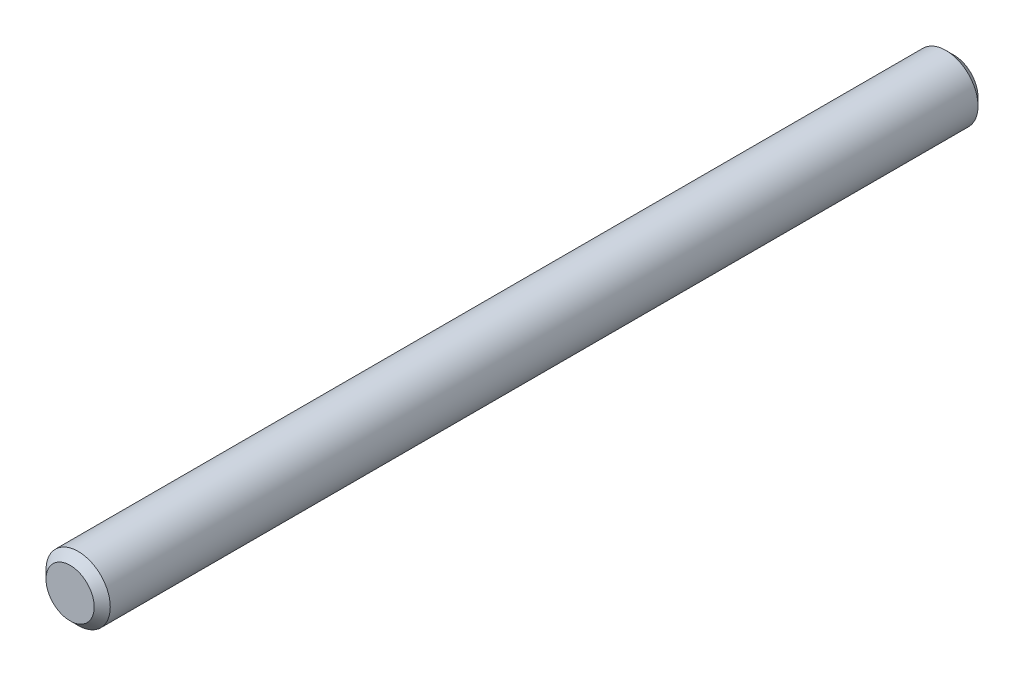
ISO-10303-21;
HEADER;
FILE_DESCRIPTION(('STEP AP214'),'2;1');
FILE_NAME('part.step','',(''),(''),'','','');
FILE_SCHEMA(('AUTOMOTIVE_DESIGN { 1 0 10303 214 1 1 1 1 }'));
ENDSEC;
DATA;
#1=APPLICATION_CONTEXT('core data for automotive mechanical design processes');
#2=APPLICATION_PROTOCOL_DEFINITION('international standard','automotive_design',2000,#1);
#3=PRODUCT_CONTEXT('',#1,'mechanical');
#4=PRODUCT('Part','Part','',(#3));
#5=PRODUCT_RELATED_PRODUCT_CATEGORY('part','',(#4));
#6=PRODUCT_DEFINITION_FORMATION('','',#4);
#7=PRODUCT_DEFINITION_CONTEXT('part definition',#1,'design');
#8=PRODUCT_DEFINITION('design','',#6,#7);
#9=PRODUCT_DEFINITION_SHAPE('','',#8);
#10=(LENGTH_UNIT() NAMED_UNIT(*) SI_UNIT(.MILLI.,.METRE.));
#11=(NAMED_UNIT(*) PLANE_ANGLE_UNIT() SI_UNIT($,.RADIAN.));
#12=(NAMED_UNIT(*) SI_UNIT($,.STERADIAN.) SOLID_ANGLE_UNIT());
#13=UNCERTAINTY_MEASURE_WITH_UNIT(LENGTH_MEASURE(1.E-05),#10,'distance_accuracy_value','');
#14=(GEOMETRIC_REPRESENTATION_CONTEXT(3) GLOBAL_UNCERTAINTY_ASSIGNED_CONTEXT((#13)) GLOBAL_UNIT_ASSIGNED_CONTEXT((#10,
#11,#12)) REPRESENTATION_CONTEXT('',''));
#15=CARTESIAN_POINT('',(0.,0.,0.));
#16=DIRECTION('',(0.,0.,1.));
#17=DIRECTION('',(1.,0.,0.));
#18=AXIS2_PLACEMENT_3D('',#15,#16,#17);
#19=CARTESIAN_POINT('',(0.,0.,11.));
#20=DIRECTION('',(0.,0.,-1.));
#21=DIRECTION('',(-1.,0.,0.));
#22=AXIS2_PLACEMENT_3D('',#19,#20,#21);
#23=CYLINDRICAL_SURFACE('',#22,0.4);
#24=CARTESIAN_POINT('',(0.,0.,0.100000000000001));
#25=DIRECTION('',(0.,0.,1.));
#26=DIRECTION('',(1.,0.,0.));
#27=AXIS2_PLACEMENT_3D('',#24,#25,#26);
#28=CIRCLE('',#27,0.4);
#29=CARTESIAN_POINT('',(0.4,0.,0.100000000000001));
#30=VERTEX_POINT('',#29);
#31=EDGE_CURVE('E46',#30,#30,#28,.T.);
#32=ORIENTED_EDGE('',*,*,#31,.T.);
#33=EDGE_LOOP('',(#32));
#34=FACE_BOUND('',#33,.T.);
#35=CARTESIAN_POINT('',(0.,0.,10.9));
#36=DIRECTION('',(0.,0.,1.));
#37=DIRECTION('',(1.,0.,0.));
#38=AXIS2_PLACEMENT_3D('',#35,#36,#37);
#39=CIRCLE('',#38,0.4);
#40=CARTESIAN_POINT('',(0.4,0.,10.9));
#41=VERTEX_POINT('',#40);
#42=EDGE_CURVE('E50',#41,#41,#39,.F.);
#43=ORIENTED_EDGE('',*,*,#42,.T.);
#44=EDGE_LOOP('',(#43));
#45=FACE_BOUND('',#44,.T.);
#46=ADVANCED_FACE('F35',(#34,#45),#23,.T.);
#47=CARTESIAN_POINT('',(0.,0.,11.));
#48=DIRECTION('',(0.,0.,1.));
#49=DIRECTION('',(1.,0.,0.));
#50=AXIS2_PLACEMENT_3D('',#47,#48,#49);
#51=PLANE('',#50);
#52=CARTESIAN_POINT('',(0.,0.,11.));
#53=DIRECTION('',(0.,0.,1.));
#54=DIRECTION('',(1.,0.,0.));
#55=AXIS2_PLACEMENT_3D('',#52,#53,#54);
#56=CIRCLE('',#55,0.299999999999998);
#57=CARTESIAN_POINT('',(0.299999999999998,0.,11.));
#58=VERTEX_POINT('',#57);
#59=EDGE_CURVE('E10',#58,#58,#56,.T.);
#60=ORIENTED_EDGE('',*,*,#59,.T.);
#61=EDGE_LOOP('',(#60));
#62=FACE_BOUND('',#61,.T.);
#63=ADVANCED_FACE('F66',(#62),#51,.T.);
#64=CARTESIAN_POINT('',(0.,0.,0.));
#65=DIRECTION('',(0.,0.,1.));
#66=DIRECTION('',(1.,0.,0.));
#67=AXIS2_PLACEMENT_3D('',#64,#65,#66);
#68=PLANE('',#67);
#69=CARTESIAN_POINT('',(0.,0.,0.));
#70=DIRECTION('',(0.,0.,1.));
#71=DIRECTION('',(1.,0.,0.));
#72=AXIS2_PLACEMENT_3D('',#69,#70,#71);
#73=CIRCLE('',#72,0.299999999999998);
#74=CARTESIAN_POINT('',(0.299999999999998,0.,0.));
#75=VERTEX_POINT('',#74);
#76=EDGE_CURVE('E42',#75,#75,#73,.F.);
#77=ORIENTED_EDGE('',*,*,#76,.T.);
#78=EDGE_LOOP('',(#77));
#79=FACE_BOUND('',#78,.T.);
#80=ADVANCED_FACE('F63',(#79),#68,.F.);
#81=CARTESIAN_POINT('',(0.,0.,0.100000000000001));
#82=DIRECTION('',(0.,0.,1.));
#83=DIRECTION('',(1.,0.,0.));
#84=AXIS2_PLACEMENT_3D('',#81,#82,#83);
#85=CONICAL_SURFACE('',#84,0.4,0.785398163397452);
#86=ORIENTED_EDGE('',*,*,#76,.F.);
#87=EDGE_LOOP('',(#86));
#88=FACE_BOUND('',#87,.T.);
#89=ORIENTED_EDGE('',*,*,#31,.F.);
#90=EDGE_LOOP('',(#89));
#91=FACE_BOUND('',#90,.T.);
#92=ADVANCED_FACE('F59',(#88,#91),#85,.T.);
#93=CARTESIAN_POINT('',(0.,0.,11.));
#94=DIRECTION('',(0.,0.,-1.));
#95=DIRECTION('',(-1.,0.,0.));
#96=AXIS2_PLACEMENT_3D('',#93,#94,#95);
#97=CONICAL_SURFACE('',#96,0.299999999999998,0.785398163397452);
#98=ORIENTED_EDGE('',*,*,#42,.F.);
#99=EDGE_LOOP('',(#98));
#100=FACE_BOUND('',#99,.T.);
#101=ORIENTED_EDGE('',*,*,#59,.F.);
#102=EDGE_LOOP('',(#101));
#103=FACE_BOUND('',#102,.T.);
#104=ADVANCED_FACE('F37',(#100,#103),#97,.T.);
#105=CLOSED_SHELL('',(#46,#63,#80,#92,#104));
#106=MANIFOLD_SOLID_BREP('B2',#105);
#107=ADVANCED_BREP_SHAPE_REPRESENTATION('',(#18,#106),#14);
#108=SHAPE_DEFINITION_REPRESENTATION(#9,#107);
ENDSEC;
END-ISO-10303-21;
